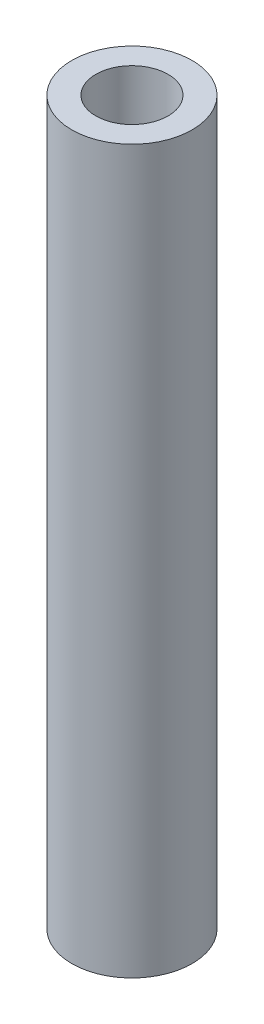
ISO-10303-21;
HEADER;
FILE_DESCRIPTION(('STEP AP214'),'2;1');
FILE_NAME('part.step','',(''),(''),'','','');
FILE_SCHEMA(('AUTOMOTIVE_DESIGN { 1 0 10303 214 1 1 1 1 }'));
ENDSEC;
DATA;
#1=APPLICATION_CONTEXT('core data for automotive mechanical design processes');
#2=APPLICATION_PROTOCOL_DEFINITION('international standard','automotive_design',2000,#1);
#3=PRODUCT_CONTEXT('',#1,'mechanical');
#4=PRODUCT('Part','Part','',(#3));
#5=PRODUCT_RELATED_PRODUCT_CATEGORY('part','',(#4));
#6=PRODUCT_DEFINITION_FORMATION('','',#4);
#7=PRODUCT_DEFINITION_CONTEXT('part definition',#1,'design');
#8=PRODUCT_DEFINITION('design','',#6,#7);
#9=PRODUCT_DEFINITION_SHAPE('','',#8);
#10=(LENGTH_UNIT() NAMED_UNIT(*) SI_UNIT(.MILLI.,.METRE.));
#11=(NAMED_UNIT(*) PLANE_ANGLE_UNIT() SI_UNIT($,.RADIAN.));
#12=(NAMED_UNIT(*) SI_UNIT($,.STERADIAN.) SOLID_ANGLE_UNIT());
#13=UNCERTAINTY_MEASURE_WITH_UNIT(LENGTH_MEASURE(1.E-05),#10,'distance_accuracy_value','');
#14=(GEOMETRIC_REPRESENTATION_CONTEXT(3) GLOBAL_UNCERTAINTY_ASSIGNED_CONTEXT((#13)) GLOBAL_UNIT_ASSIGNED_CONTEXT((#10,
#11,#12)) REPRESENTATION_CONTEXT('',''));
#15=CARTESIAN_POINT('',(0.,0.,0.));
#16=DIRECTION('',(0.,0.,1.));
#17=DIRECTION('',(1.,0.,0.));
#18=AXIS2_PLACEMENT_3D('',#15,#16,#17);
#19=CARTESIAN_POINT('',(0.,30.,0.));
#20=DIRECTION('',(0.,1.,0.));
#21=DIRECTION('',(0.,0.,1.));
#22=AXIS2_PLACEMENT_3D('',#19,#20,#21);
#23=PLANE('',#22);
#24=CARTESIAN_POINT('',(0.,30.,0.));
#25=DIRECTION('',(0.,1.,0.));
#26=DIRECTION('',(0.,0.,1.));
#27=AXIS2_PLACEMENT_3D('',#24,#25,#26);
#28=CIRCLE('',#27,2.5);
#29=CARTESIAN_POINT('',(0.,30.,2.5));
#30=VERTEX_POINT('',#29);
#31=EDGE_CURVE('E10',#30,#30,#28,.T.);
#32=ORIENTED_EDGE('',*,*,#31,.T.);
#33=EDGE_LOOP('',(#32));
#34=FACE_BOUND('',#33,.T.);
#35=CARTESIAN_POINT('',(0.,30.,0.));
#36=DIRECTION('',(0.,1.,0.));
#37=DIRECTION('',(0.,0.,1.));
#38=AXIS2_PLACEMENT_3D('',#35,#36,#37);
#39=CIRCLE('',#38,1.5);
#40=CARTESIAN_POINT('',(0.,30.,1.5));
#41=VERTEX_POINT('',#40);
#42=EDGE_CURVE('E56',#41,#41,#39,.T.);
#43=ORIENTED_EDGE('',*,*,#42,.F.);
#44=EDGE_LOOP('',(#43));
#45=FACE_BOUND('',#44,.T.);
#46=ADVANCED_FACE('F43',(#34,#45),#23,.T.);
#47=CARTESIAN_POINT('',(0.,0.,0.));
#48=DIRECTION('',(0.,1.,0.));
#49=DIRECTION('',(0.,0.,1.));
#50=AXIS2_PLACEMENT_3D('',#47,#48,#49);
#51=PLANE('',#50);
#52=CARTESIAN_POINT('',(0.,0.,0.));
#53=DIRECTION('',(0.,1.,0.));
#54=DIRECTION('',(0.,0.,1.));
#55=AXIS2_PLACEMENT_3D('',#52,#53,#54);
#56=CIRCLE('',#55,2.5);
#57=CARTESIAN_POINT('',(0.,0.,2.5));
#58=VERTEX_POINT('',#57);
#59=EDGE_CURVE('E47',#58,#58,#56,.T.);
#60=ORIENTED_EDGE('',*,*,#59,.F.);
#61=EDGE_LOOP('',(#60));
#62=FACE_BOUND('',#61,.T.);
#63=CARTESIAN_POINT('',(0.,0.,0.));
#64=DIRECTION('',(0.,1.,0.));
#65=DIRECTION('',(0.,0.,1.));
#66=AXIS2_PLACEMENT_3D('',#63,#64,#65);
#67=CIRCLE('',#66,1.5);
#68=CARTESIAN_POINT('',(0.,0.,1.5));
#69=VERTEX_POINT('',#68);
#70=EDGE_CURVE('E58',#69,#69,#67,.T.);
#71=ORIENTED_EDGE('',*,*,#70,.T.);
#72=EDGE_LOOP('',(#71));
#73=FACE_BOUND('',#72,.T.);
#74=ADVANCED_FACE('F70',(#62,#73),#51,.F.);
#75=CARTESIAN_POINT('',(0.,30.,0.));
#76=DIRECTION('',(0.,-1.,0.));
#77=DIRECTION('',(0.,0.,-1.));
#78=AXIS2_PLACEMENT_3D('',#75,#76,#77);
#79=CYLINDRICAL_SURFACE('',#78,2.5);
#80=ORIENTED_EDGE('',*,*,#31,.F.);
#81=EDGE_LOOP('',(#80));
#82=FACE_BOUND('',#81,.T.);
#83=ORIENTED_EDGE('',*,*,#59,.T.);
#84=EDGE_LOOP('',(#83));
#85=FACE_BOUND('',#84,.T.);
#86=ADVANCED_FACE('F45',(#82,#85),#79,.T.);
#87=CARTESIAN_POINT('',(0.,30.,0.));
#88=DIRECTION('',(0.,-1.,0.));
#89=DIRECTION('',(0.,0.,-1.));
#90=AXIS2_PLACEMENT_3D('',#87,#88,#89);
#91=CYLINDRICAL_SURFACE('',#90,1.5);
#92=ORIENTED_EDGE('',*,*,#42,.T.);
#93=EDGE_LOOP('',(#92));
#94=FACE_BOUND('',#93,.T.);
#95=ORIENTED_EDGE('',*,*,#70,.F.);
#96=EDGE_LOOP('',(#95));
#97=FACE_BOUND('',#96,.T.);
#98=ADVANCED_FACE('F66',(#94,#97),#91,.F.);
#99=CLOSED_SHELL('',(#46,#74,#86,#98));
#100=MANIFOLD_SOLID_BREP('B2',#99);
#101=ADVANCED_BREP_SHAPE_REPRESENTATION('',(#18,#100),#14);
#102=SHAPE_DEFINITION_REPRESENTATION(#9,#101);
ENDSEC;
END-ISO-10303-21;
